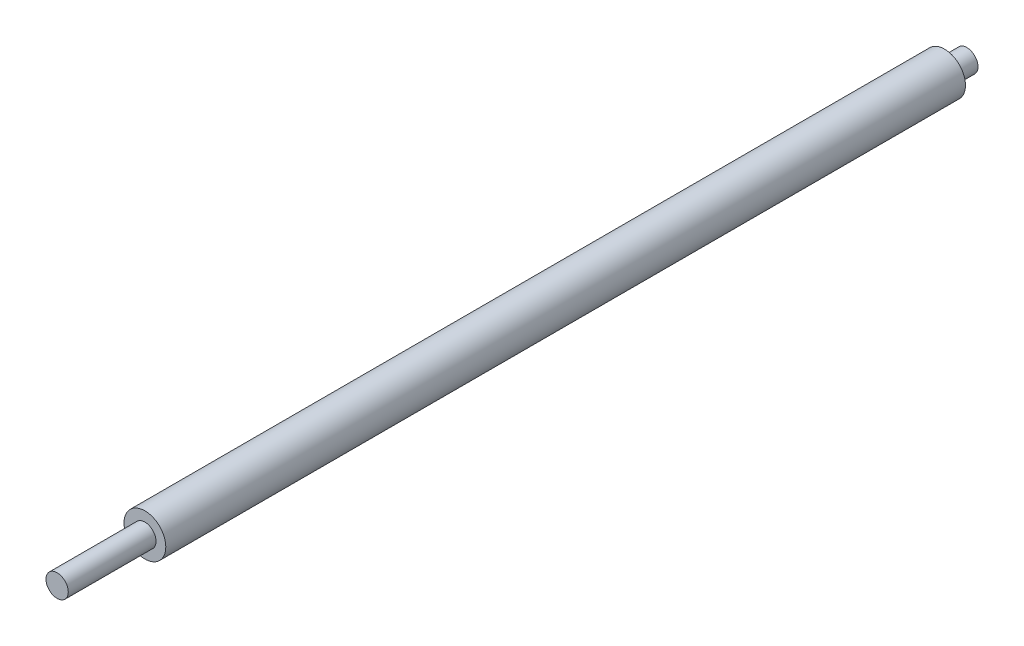
ISO-10303-21;
HEADER;
FILE_DESCRIPTION(('STEP AP214'),'2;1');
FILE_NAME('part.step','',(''),(''),'','','');
FILE_SCHEMA(('AUTOMOTIVE_DESIGN { 1 0 10303 214 1 1 1 1 }'));
ENDSEC;
DATA;
#1=APPLICATION_CONTEXT('core data for automotive mechanical design processes');
#2=APPLICATION_PROTOCOL_DEFINITION('international standard','automotive_design',2000,#1);
#3=PRODUCT_CONTEXT('',#1,'mechanical');
#4=PRODUCT('Part','Part','',(#3));
#5=PRODUCT_RELATED_PRODUCT_CATEGORY('part','',(#4));
#6=PRODUCT_DEFINITION_FORMATION('','',#4);
#7=PRODUCT_DEFINITION_CONTEXT('part definition',#1,'design');
#8=PRODUCT_DEFINITION('design','',#6,#7);
#9=PRODUCT_DEFINITION_SHAPE('','',#8);
#10=(LENGTH_UNIT() NAMED_UNIT(*) SI_UNIT(.MILLI.,.METRE.));
#11=(NAMED_UNIT(*) PLANE_ANGLE_UNIT() SI_UNIT($,.RADIAN.));
#12=(NAMED_UNIT(*) SI_UNIT($,.STERADIAN.) SOLID_ANGLE_UNIT());
#13=UNCERTAINTY_MEASURE_WITH_UNIT(LENGTH_MEASURE(1.E-05),#10,'distance_accuracy_value','');
#14=(GEOMETRIC_REPRESENTATION_CONTEXT(3) GLOBAL_UNCERTAINTY_ASSIGNED_CONTEXT((#13)) GLOBAL_UNIT_ASSIGNED_CONTEXT((#10,
#11,#12)) REPRESENTATION_CONTEXT('',''));
#15=CARTESIAN_POINT('',(0.,0.,0.));
#16=DIRECTION('',(0.,0.,1.));
#17=DIRECTION('',(1.,0.,0.));
#18=AXIS2_PLACEMENT_3D('',#15,#16,#17);
#19=CARTESIAN_POINT('',(0.,0.,295.));
#20=DIRECTION('',(0.,0.,1.));
#21=DIRECTION('',(1.,0.,0.));
#22=AXIS2_PLACEMENT_3D('',#19,#20,#21);
#23=PLANE('',#22);
#24=CARTESIAN_POINT('',(0.,0.,295.));
#25=DIRECTION('',(0.,0.,1.));
#26=DIRECTION('',(1.,0.,0.));
#27=AXIS2_PLACEMENT_3D('',#24,#25,#26);
#28=CIRCLE('',#27,7.5);
#29=CARTESIAN_POINT('',(7.5,0.,295.));
#30=VERTEX_POINT('',#29);
#31=EDGE_CURVE('E48',#30,#30,#28,.T.);
#32=ORIENTED_EDGE('',*,*,#31,.T.);
#33=EDGE_LOOP('',(#32));
#34=FACE_BOUND('',#33,.T.);
#35=CARTESIAN_POINT('',(0.,0.,295.));
#36=DIRECTION('',(0.,0.,1.));
#37=DIRECTION('',(1.,0.,0.));
#38=AXIS2_PLACEMENT_3D('',#35,#36,#37);
#39=CIRCLE('',#38,4.);
#40=CARTESIAN_POINT('',(4.,0.,295.));
#41=VERTEX_POINT('',#40);
#42=EDGE_CURVE('E56',#41,#41,#39,.T.);
#43=ORIENTED_EDGE('',*,*,#42,.F.);
#44=EDGE_LOOP('',(#43));
#45=FACE_BOUND('',#44,.T.);
#46=ADVANCED_FACE('F37',(#34,#45),#23,.T.);
#47=CARTESIAN_POINT('',(0.,0.,8.));
#48=DIRECTION('',(0.,0.,-1.));
#49=DIRECTION('',(-1.,0.,0.));
#50=AXIS2_PLACEMENT_3D('',#47,#48,#49);
#51=CYLINDRICAL_SURFACE('',#50,4.);
#52=CARTESIAN_POINT('',(0.,0.,8.));
#53=DIRECTION('',(0.,0.,1.));
#54=DIRECTION('',(1.,0.,0.));
#55=AXIS2_PLACEMENT_3D('',#52,#53,#54);
#56=CIRCLE('',#55,4.);
#57=CARTESIAN_POINT('',(4.,0.,8.));
#58=VERTEX_POINT('',#57);
#59=EDGE_CURVE('E10',#58,#58,#56,.T.);
#60=ORIENTED_EDGE('',*,*,#59,.F.);
#61=EDGE_LOOP('',(#60));
#62=FACE_BOUND('',#61,.T.);
#63=CARTESIAN_POINT('',(0.,0.,0.));
#64=DIRECTION('',(0.,0.,1.));
#65=DIRECTION('',(1.,0.,0.));
#66=AXIS2_PLACEMENT_3D('',#63,#64,#65);
#67=CIRCLE('',#66,4.);
#68=CARTESIAN_POINT('',(4.,0.,0.));
#69=VERTEX_POINT('',#68);
#70=EDGE_CURVE('E41',#69,#69,#67,.T.);
#71=ORIENTED_EDGE('',*,*,#70,.T.);
#72=EDGE_LOOP('',(#71));
#73=FACE_BOUND('',#72,.T.);
#74=ADVANCED_FACE('F39',(#62,#73),#51,.T.);
#75=CARTESIAN_POINT('',(0.,0.,0.));
#76=DIRECTION('',(0.,0.,1.));
#77=DIRECTION('',(1.,0.,0.));
#78=AXIS2_PLACEMENT_3D('',#75,#76,#77);
#79=PLANE('',#78);
#80=ORIENTED_EDGE('',*,*,#70,.F.);
#81=EDGE_LOOP('',(#80));
#82=FACE_BOUND('',#81,.T.);
#83=ADVANCED_FACE('F77',(#82),#79,.F.);
#84=CARTESIAN_POINT('',(0.,0.,8.));
#85=DIRECTION('',(0.,0.,1.));
#86=DIRECTION('',(1.,0.,0.));
#87=AXIS2_PLACEMENT_3D('',#84,#85,#86);
#88=PLANE('',#87);
#89=CARTESIAN_POINT('',(0.,0.,8.));
#90=DIRECTION('',(0.,0.,1.));
#91=DIRECTION('',(1.,0.,0.));
#92=AXIS2_PLACEMENT_3D('',#89,#90,#91);
#93=CIRCLE('',#92,7.5);
#94=CARTESIAN_POINT('',(7.5,0.,8.));
#95=VERTEX_POINT('',#94);
#96=EDGE_CURVE('E50',#95,#95,#93,.T.);
#97=ORIENTED_EDGE('',*,*,#96,.F.);
#98=EDGE_LOOP('',(#97));
#99=FACE_BOUND('',#98,.T.);
#100=ORIENTED_EDGE('',*,*,#59,.T.);
#101=EDGE_LOOP('',(#100));
#102=FACE_BOUND('',#101,.T.);
#103=ADVANCED_FACE('F81',(#99,#102),#88,.F.);
#104=CARTESIAN_POINT('',(0.,0.,295.));
#105=DIRECTION('',(0.,0.,-1.));
#106=DIRECTION('',(-1.,0.,0.));
#107=AXIS2_PLACEMENT_3D('',#104,#105,#106);
#108=CYLINDRICAL_SURFACE('',#107,7.5);
#109=ORIENTED_EDGE('',*,*,#31,.F.);
#110=EDGE_LOOP('',(#109));
#111=FACE_BOUND('',#110,.T.);
#112=ORIENTED_EDGE('',*,*,#96,.T.);
#113=EDGE_LOOP('',(#112));
#114=FACE_BOUND('',#113,.T.);
#115=ADVANCED_FACE('F67',(#111,#114),#108,.T.);
#116=CARTESIAN_POINT('',(0.,0.,326.5));
#117=DIRECTION('',(0.,0.,-1.));
#118=DIRECTION('',(-1.,0.,0.));
#119=AXIS2_PLACEMENT_3D('',#116,#117,#118);
#120=CYLINDRICAL_SURFACE('',#119,4.);
#121=CARTESIAN_POINT('',(0.,0.,326.5));
#122=DIRECTION('',(0.,0.,1.));
#123=DIRECTION('',(1.,0.,0.));
#124=AXIS2_PLACEMENT_3D('',#121,#122,#123);
#125=CIRCLE('',#124,4.);
#126=CARTESIAN_POINT('',(4.,0.,326.5));
#127=VERTEX_POINT('',#126);
#128=EDGE_CURVE('E53',#127,#127,#125,.T.);
#129=ORIENTED_EDGE('',*,*,#128,.F.);
#130=EDGE_LOOP('',(#129));
#131=FACE_BOUND('',#130,.T.);
#132=ORIENTED_EDGE('',*,*,#42,.T.);
#133=EDGE_LOOP('',(#132));
#134=FACE_BOUND('',#133,.T.);
#135=ADVANCED_FACE('F64',(#131,#134),#120,.T.);
#136=CARTESIAN_POINT('',(0.,0.,326.5));
#137=DIRECTION('',(0.,0.,1.));
#138=DIRECTION('',(1.,0.,0.));
#139=AXIS2_PLACEMENT_3D('',#136,#137,#138);
#140=PLANE('',#139);
#141=ORIENTED_EDGE('',*,*,#128,.T.);
#142=EDGE_LOOP('',(#141));
#143=FACE_BOUND('',#142,.T.);
#144=ADVANCED_FACE('F62',(#143),#140,.T.);
#145=CLOSED_SHELL('',(#46,#74,#83,#103,#115,#135,#144));
#146=MANIFOLD_SOLID_BREP('B2',#145);
#147=ADVANCED_BREP_SHAPE_REPRESENTATION('',(#18,#146),#14);
#148=SHAPE_DEFINITION_REPRESENTATION(#9,#147);
ENDSEC;
END-ISO-10303-21;
